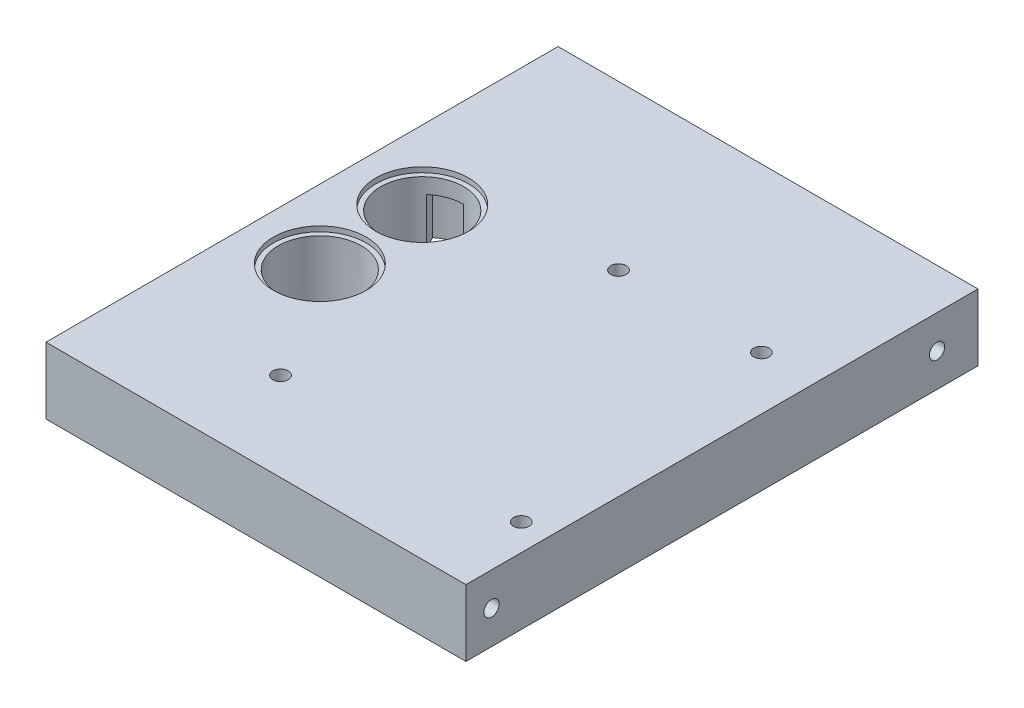
ISO-10303-21;
HEADER;
FILE_DESCRIPTION(('STEP AP214'),'2;1');
FILE_NAME('part.step','',(''),(''),'','','');
FILE_SCHEMA(('AUTOMOTIVE_DESIGN { 1 0 10303 214 1 1 1 1 }'));
ENDSEC;
DATA;
#1=APPLICATION_CONTEXT('core data for automotive mechanical design processes');
#2=APPLICATION_PROTOCOL_DEFINITION('international standard','automotive_design',2000,#1);
#3=PRODUCT_CONTEXT('',#1,'mechanical');
#4=PRODUCT('Part','Part','',(#3));
#5=PRODUCT_RELATED_PRODUCT_CATEGORY('part','',(#4));
#6=PRODUCT_DEFINITION_FORMATION('','',#4);
#7=PRODUCT_DEFINITION_CONTEXT('part definition',#1,'design');
#8=PRODUCT_DEFINITION('design','',#6,#7);
#9=PRODUCT_DEFINITION_SHAPE('','',#8);
#10=(LENGTH_UNIT() NAMED_UNIT(*) SI_UNIT(.MILLI.,.METRE.));
#11=(NAMED_UNIT(*) PLANE_ANGLE_UNIT() SI_UNIT($,.RADIAN.));
#12=(NAMED_UNIT(*) SI_UNIT($,.STERADIAN.) SOLID_ANGLE_UNIT());
#13=UNCERTAINTY_MEASURE_WITH_UNIT(LENGTH_MEASURE(1.E-05),#10,'distance_accuracy_value','');
#14=(GEOMETRIC_REPRESENTATION_CONTEXT(3) GLOBAL_UNCERTAINTY_ASSIGNED_CONTEXT((#13)) GLOBAL_UNIT_ASSIGNED_CONTEXT((#10,
#11,#12)) REPRESENTATION_CONTEXT('',''));
#15=CARTESIAN_POINT('',(0.,0.,0.));
#16=DIRECTION('',(0.,0.,1.));
#17=DIRECTION('',(1.,0.,0.));
#18=AXIS2_PLACEMENT_3D('',#15,#16,#17);
#19=CARTESIAN_POINT('',(0.,-7.,0.));
#20=DIRECTION('',(0.,1.,0.));
#21=DIRECTION('',(0.,0.,1.));
#22=AXIS2_PLACEMENT_3D('',#19,#20,#21);
#23=PLANE('',#22);
#24=DIRECTION('',(-1.,0.,0.));
#25=VECTOR('',#24,1.);
#26=CARTESIAN_POINT('',(33.,-7.00000000000001,-50.));
#27=LINE('',#26,#25);
#28=CARTESIAN_POINT('',(112.,-7.00000000000001,-50.));
#29=VERTEX_POINT('',#28);
#30=CARTESIAN_POINT('',(30.,-7.,-50.));
#31=VERTEX_POINT('',#30);
#32=EDGE_CURVE('E181',#29,#31,#27,.T.);
#33=ORIENTED_EDGE('',*,*,#32,.T.);
#34=DIRECTION('',(0.,0.,-1.));
#35=VECTOR('',#34,1.);
#36=CARTESIAN_POINT('',(30.,-7.,0.));
#37=LINE('',#36,#35);
#38=CARTESIAN_POINT('',(30.,-7.,50.));
#39=VERTEX_POINT('',#38);
#40=EDGE_CURVE('E186',#39,#31,#37,.T.);
#41=ORIENTED_EDGE('',*,*,#40,.F.);
#42=DIRECTION('',(-1.,0.,0.));
#43=VECTOR('',#42,1.);
#44=CARTESIAN_POINT('',(112.,-7.,50.));
#45=LINE('',#44,#43);
#46=CARTESIAN_POINT('',(112.,-7.,50.));
#47=VERTEX_POINT('',#46);
#48=EDGE_CURVE('E209',#47,#39,#45,.T.);
#49=ORIENTED_EDGE('',*,*,#48,.F.);
#50=DIRECTION('',(0.,0.,-1.));
#51=VECTOR('',#50,1.);
#52=CARTESIAN_POINT('',(112.,-7.00000000000001,48.));
#53=LINE('',#52,#51);
#54=EDGE_CURVE('E188',#47,#29,#53,.T.);
#55=ORIENTED_EDGE('',*,*,#54,.T.);
#56=EDGE_LOOP('',(#33,#41,#49,#55));
#57=FACE_BOUND('',#56,.T.);
#58=CARTESIAN_POINT('',(101.6,-7.,-18.1));
#59=DIRECTION('',(0.,1.,0.));
#60=DIRECTION('',(0.,0.,1.));
#61=AXIS2_PLACEMENT_3D('',#58,#59,#60);
#62=CIRCLE('',#61,1.5);
#63=CARTESIAN_POINT('',(101.6,-7.,-16.6));
#64=VERTEX_POINT('',#63);
#65=EDGE_CURVE('E45',#64,#64,#62,.F.);
#66=ORIENTED_EDGE('',*,*,#65,.T.);
#67=EDGE_LOOP('',(#66));
#68=FACE_BOUND('',#67,.T.);
#69=CARTESIAN_POINT('',(43.4696407996142,-7.,10.));
#70=DIRECTION('',(0.,1.,0.));
#71=DIRECTION('',(0.,0.,1.));
#72=AXIS2_PLACEMENT_3D('',#69,#70,#71);
#73=CIRCLE('',#72,9.05);
#74=CARTESIAN_POINT('',(43.4696407996142,-7.,19.05));
#75=VERTEX_POINT('',#74);
#76=EDGE_CURVE('E799',#75,#75,#73,.T.);
#77=ORIENTED_EDGE('',*,*,#76,.F.);
#78=EDGE_LOOP('',(#77));
#79=FACE_BOUND('',#78,.T.);
#80=CARTESIAN_POINT('',(43.4696407996142,-7.,-10.));
#81=DIRECTION('',(0.,1.,0.));
#82=DIRECTION('',(0.,0.,1.));
#83=AXIS2_PLACEMENT_3D('',#80,#81,#82);
#84=CIRCLE('',#83,9.05);
#85=CARTESIAN_POINT('',(43.4696407996142,-7.,-0.95));
#86=VERTEX_POINT('',#85);
#87=EDGE_CURVE('E785',#86,#86,#84,.T.);
#88=ORIENTED_EDGE('',*,*,#87,.F.);
#89=EDGE_LOOP('',(#88));
#90=FACE_BOUND('',#89,.T.);
#91=CARTESIAN_POINT('',(106.8,-7.,34.));
#92=DIRECTION('',(0.,1.,0.));
#93=DIRECTION('',(0.,0.,1.));
#94=AXIS2_PLACEMENT_3D('',#91,#92,#93);
#95=CIRCLE('',#94,1.5);
#96=CARTESIAN_POINT('',(106.8,-7.,35.5));
#97=VERTEX_POINT('',#96);
#98=EDGE_CURVE('E229',#97,#97,#95,.F.);
#99=ORIENTED_EDGE('',*,*,#98,.T.);
#100=EDGE_LOOP('',(#99));
#101=FACE_BOUND('',#100,.T.);
#102=CARTESIAN_POINT('',(58.5,-7.,32.7));
#103=DIRECTION('',(0.,1.,0.));
#104=DIRECTION('',(0.,0.,1.));
#105=AXIS2_PLACEMENT_3D('',#102,#103,#104);
#106=CIRCLE('',#105,1.5);
#107=CARTESIAN_POINT('',(58.5,-7.,34.2));
#108=VERTEX_POINT('',#107);
#109=EDGE_CURVE('E217',#108,#108,#106,.F.);
#110=ORIENTED_EDGE('',*,*,#109,.T.);
#111=EDGE_LOOP('',(#110));
#112=FACE_BOUND('',#111,.T.);
#113=CARTESIAN_POINT('',(73.7,-7.,-18.1));
#114=DIRECTION('',(0.,1.,0.));
#115=DIRECTION('',(0.,0.,1.));
#116=AXIS2_PLACEMENT_3D('',#113,#114,#115);
#117=CIRCLE('',#116,1.5);
#118=CARTESIAN_POINT('',(73.7,-7.,-16.6));
#119=VERTEX_POINT('',#118);
#120=EDGE_CURVE('E210',#119,#119,#117,.F.);
#121=ORIENTED_EDGE('',*,*,#120,.T.);
#122=EDGE_LOOP('',(#121));
#123=FACE_BOUND('',#122,.T.);
#124=ADVANCED_FACE('F41',(#57,#68,#79,#90,#101,#112,#123),#23,.T.);
#125=CARTESIAN_POINT('',(0.,-11.,0.));
#126=DIRECTION('',(0.,-1.,0.));
#127=DIRECTION('',(0.,0.,-1.));
#128=AXIS2_PLACEMENT_3D('',#125,#126,#127);
#129=PLANE('',#128);
#130=CARTESIAN_POINT('',(43.4696407996142,-11.,-10.));
#131=DIRECTION('',(0.,-1.,0.));
#132=DIRECTION('',(0.,0.,-1.));
#133=AXIS2_PLACEMENT_3D('',#130,#131,#132);
#134=CIRCLE('',#133,8.1);
#135=CARTESIAN_POINT('',(51.5679464049852,-11.,-10.1656693152558));
#136=VERTEX_POINT('',#135);
#137=CARTESIAN_POINT('',(49.9848907595689,-11.,-14.8126414742126));
#138=VERTEX_POINT('',#137);
#139=EDGE_CURVE('E768',#136,#138,#134,.F.);
#140=ORIENTED_EDGE('',*,*,#139,.T.);
#141=DIRECTION('',(-0.975923113332999,0.,0.218114824948757));
#142=VECTOR('',#141,1.);
#143=CARTESIAN_POINT('',(52.5936016820828,-11.,-15.3956776974892));
#144=LINE('',#143,#142);
#145=CARTESIAN_POINT('',(52.5936016820828,-11.,-15.3956776974892));
#146=VERTEX_POINT('',#145);
#147=EDGE_CURVE('E820',#146,#138,#144,.T.);
#148=ORIENTED_EDGE('',*,*,#147,.F.);
#149=CARTESIAN_POINT('',(43.4696407996142,-11.,-10.));
#150=DIRECTION('',(0.,-1.,0.));
#151=DIRECTION('',(0.,0.,-1.));
#152=AXIS2_PLACEMENT_3D('',#149,#150,#151);
#153=CIRCLE('',#152,10.6);
#154=CARTESIAN_POINT('',(54.0339338822389,-11.,-10.8693167802409));
#155=VERTEX_POINT('',#154);
#156=EDGE_CURVE('E751',#155,#146,#153,.F.);
#157=ORIENTED_EDGE('',*,*,#156,.F.);
#158=DIRECTION('',(0.961618695996556,0.,-0.274389291900911));
#159=VECTOR('',#158,1.);
#160=CARTESIAN_POINT('',(1.20023216660807,-11.,4.2063073341928));
#161=LINE('',#160,#159);
#162=EDGE_CURVE('E757',#136,#155,#161,.T.);
#163=ORIENTED_EDGE('',*,*,#162,.F.);
#164=EDGE_LOOP('',(#140,#148,#157,#163));
#165=FACE_BOUND('',#164,.T.);
#166=ADVANCED_FACE('F258',(#165),#129,.T.);
#167=CARTESIAN_POINT('',(43.4696407996144,-11.,-20.6));
#168=VERTEX_POINT('',#167);
#169=CARTESIAN_POINT('',(37.0686915926422,-11.,-18.4491330472283));
#170=VERTEX_POINT('',#169);
#171=EDGE_CURVE('E742',#168,#170,#153,.F.);
#172=ORIENTED_EDGE('',*,*,#171,.F.);
#173=DIRECTION('',(0.,0.,-1.));
#174=VECTOR('',#173,1.);
#175=CARTESIAN_POINT('',(43.4696407996143,-11.,-18.1));
#176=LINE('',#175,#174);
#177=CARTESIAN_POINT('',(43.4696407996143,-11.,-18.1));
#178=VERTEX_POINT('',#177);
#179=EDGE_CURVE('E743',#178,#168,#176,.T.);
#180=ORIENTED_EDGE('',*,*,#179,.F.);
#181=CARTESIAN_POINT('',(38.1898633031215,-11.,-16.1427965608124));
#182=VERTEX_POINT('',#181);
#183=EDGE_CURVE('E767',#178,#182,#134,.F.);
#184=ORIENTED_EDGE('',*,*,#183,.T.);
#185=DIRECTION('',(-0.437204036177802,0.,-0.899362346748984));
#186=VECTOR('',#185,1.);
#187=CARTESIAN_POINT('',(37.2373972684535,-11.,-18.1020924896115));
#188=LINE('',#187,#186);
#189=EDGE_CURVE('E746',#182,#170,#188,.T.);
#190=ORIENTED_EDGE('',*,*,#189,.T.);
#191=EDGE_LOOP('',(#172,#180,#184,#190));
#192=FACE_BOUND('',#191,.T.);
#193=ADVANCED_FACE('F263',(#192),#129,.T.);
#194=CARTESIAN_POINT('',(0.,-11.,0.));
#195=DIRECTION('',(0.,-1.,0.));
#196=DIRECTION('',(0.,0.,1.));
#197=AXIS2_PLACEMENT_3D('',#194,#195,#196);
#198=PLANE('',#197);
#199=DIRECTION('',(0.,0.,1.));
#200=VECTOR('',#199,1.);
#201=CARTESIAN_POINT('',(43.4696407996143,-11.,18.1));
#202=LINE('',#201,#200);
#203=CARTESIAN_POINT('',(43.4696407996143,-11.,18.1));
#204=VERTEX_POINT('',#203);
#205=CARTESIAN_POINT('',(43.4696407996144,-11.,20.6));
#206=VERTEX_POINT('',#205);
#207=EDGE_CURVE('E912',#204,#206,#202,.T.);
#208=ORIENTED_EDGE('',*,*,#207,.T.);
#209=CARTESIAN_POINT('',(43.4696407996142,-11.,10.));
#210=DIRECTION('',(0.,1.,0.));
#211=DIRECTION('',(0.,0.,1.));
#212=AXIS2_PLACEMENT_3D('',#209,#210,#211);
#213=CIRCLE('',#212,10.6);
#214=CARTESIAN_POINT('',(37.0686915926422,-11.,18.4491330472283));
#215=VERTEX_POINT('',#214);
#216=EDGE_CURVE('E893',#206,#215,#213,.F.);
#217=ORIENTED_EDGE('',*,*,#216,.T.);
#218=DIRECTION('',(-0.437204036177802,0.,0.899362346748984));
#219=VECTOR('',#218,1.);
#220=CARTESIAN_POINT('',(37.2373972684535,-11.,18.1020924896115));
#221=LINE('',#220,#219);
#222=CARTESIAN_POINT('',(38.1898633031215,-11.,16.1427965608124));
#223=VERTEX_POINT('',#222);
#224=EDGE_CURVE('E900',#223,#215,#221,.T.);
#225=ORIENTED_EDGE('',*,*,#224,.F.);
#226=CARTESIAN_POINT('',(43.4696407996142,-11.,10.));
#227=DIRECTION('',(0.,1.,0.));
#228=DIRECTION('',(0.,0.,1.));
#229=AXIS2_PLACEMENT_3D('',#226,#227,#228);
#230=CIRCLE('',#229,8.1);
#231=EDGE_CURVE('E884',#204,#223,#230,.F.);
#232=ORIENTED_EDGE('',*,*,#231,.F.);
#233=EDGE_LOOP('',(#208,#217,#225,#232));
#234=FACE_BOUND('',#233,.T.);
#235=ADVANCED_FACE('F690',(#234),#198,.T.);
#236=DIRECTION('',(-0.975923113332999,0.,-0.218114824948757));
#237=VECTOR('',#236,1.);
#238=CARTESIAN_POINT('',(52.5936016820828,-11.,15.3956776974892));
#239=LINE('',#238,#237);
#240=CARTESIAN_POINT('',(52.5936016820828,-11.,15.3956776974892));
#241=VERTEX_POINT('',#240);
#242=CARTESIAN_POINT('',(49.9848907595689,-11.,14.8126414742126));
#243=VERTEX_POINT('',#242);
#244=EDGE_CURVE('E915',#241,#243,#239,.T.);
#245=ORIENTED_EDGE('',*,*,#244,.T.);
#246=CARTESIAN_POINT('',(51.5679464049852,-11.,10.1656693152558));
#247=VERTEX_POINT('',#246);
#248=EDGE_CURVE('E878',#247,#243,#230,.F.);
#249=ORIENTED_EDGE('',*,*,#248,.F.);
#250=DIRECTION('',(0.961618695996556,0.,0.274389291900911));
#251=VECTOR('',#250,1.);
#252=CARTESIAN_POINT('',(1.20023216660807,-11.,-4.2063073341928));
#253=LINE('',#252,#251);
#254=CARTESIAN_POINT('',(54.0339338822389,-11.,10.8693167802408));
#255=VERTEX_POINT('',#254);
#256=EDGE_CURVE('E872',#247,#255,#253,.T.);
#257=ORIENTED_EDGE('',*,*,#256,.T.);
#258=EDGE_CURVE('E896',#255,#241,#213,.F.);
#259=ORIENTED_EDGE('',*,*,#258,.T.);
#260=EDGE_LOOP('',(#245,#249,#257,#259));
#261=FACE_BOUND('',#260,.T.);
#262=ADVANCED_FACE('F680',(#261),#198,.T.);
#263=CARTESIAN_POINT('',(107.,-13.5,-42.));
#264=DIRECTION('',(1.,0.,0.));
#265=DIRECTION('',(0.,0.,-1.));
#266=AXIS2_PLACEMENT_3D('',#263,#264,#265);
#267=PLANE('',#266);
#268=CARTESIAN_POINT('',(107.,-13.5,-42.));
#269=DIRECTION('',(1.,0.,0.));
#270=DIRECTION('',(0.,0.,-1.));
#271=AXIS2_PLACEMENT_3D('',#268,#269,#270);
#272=CIRCLE('',#271,1.5);
#273=CARTESIAN_POINT('',(107.,-13.5,-43.5));
#274=VERTEX_POINT('',#273);
#275=EDGE_CURVE('E946',#274,#274,#272,.T.);
#276=ORIENTED_EDGE('',*,*,#275,.T.);
#277=EDGE_LOOP('',(#276));
#278=FACE_BOUND('',#277,.T.);
#279=ADVANCED_FACE('F670',(#278),#267,.T.);
#280=CARTESIAN_POINT('',(107.,-13.5,45.));
#281=DIRECTION('',(1.,0.,0.));
#282=DIRECTION('',(0.,0.,-1.));
#283=AXIS2_PLACEMENT_3D('',#280,#281,#282);
#284=PLANE('',#283);
#285=CARTESIAN_POINT('',(107.,-13.5,45.));
#286=DIRECTION('',(1.,0.,0.));
#287=DIRECTION('',(0.,0.,-1.));
#288=AXIS2_PLACEMENT_3D('',#285,#286,#287);
#289=CIRCLE('',#288,1.5);
#290=CARTESIAN_POINT('',(107.,-13.5,43.5));
#291=VERTEX_POINT('',#290);
#292=EDGE_CURVE('E941',#291,#291,#289,.T.);
#293=ORIENTED_EDGE('',*,*,#292,.T.);
#294=EDGE_LOOP('',(#293));
#295=FACE_BOUND('',#294,.T.);
#296=ADVANCED_FACE('F661',(#295),#284,.T.);
#297=CARTESIAN_POINT('',(43.4696407996142,-11.,-10.));
#298=DIRECTION('',(0.,-1.,0.));
#299=DIRECTION('',(0.,0.,-1.));
#300=AXIS2_PLACEMENT_3D('',#297,#298,#299);
#301=CYLINDRICAL_SURFACE('',#300,10.6);
#302=CARTESIAN_POINT('',(43.4696407996142,-20.,-10.));
#303=DIRECTION('',(0.,-1.,0.));
#304=DIRECTION('',(0.,0.,-1.));
#305=AXIS2_PLACEMENT_3D('',#302,#303,#304);
#306=CIRCLE('',#305,10.6);
#307=CARTESIAN_POINT('',(43.4696407996144,-20.,-20.6));
#308=VERTEX_POINT('',#307);
#309=CARTESIAN_POINT('',(37.0686915926422,-20.,-18.4491330472283));
#310=VERTEX_POINT('',#309);
#311=EDGE_CURVE('E779',#308,#310,#306,.F.);
#312=ORIENTED_EDGE('',*,*,#311,.F.);
#313=DIRECTION('',(0.,1.,0.));
#314=VECTOR('',#313,1.);
#315=CARTESIAN_POINT('',(43.4696407996144,-30.8046370087486,-20.6));
#316=LINE('',#315,#314);
#317=EDGE_CURVE('E763',#308,#168,#316,.T.);
#318=ORIENTED_EDGE('',*,*,#317,.T.);
#319=ORIENTED_EDGE('',*,*,#171,.T.);
#320=DIRECTION('',(0.,-1.,0.));
#321=VECTOR('',#320,1.);
#322=CARTESIAN_POINT('',(37.0686915926422,-11.,-18.4491330472283));
#323=LINE('',#322,#321);
#324=EDGE_CURVE('E782',#170,#310,#323,.T.);
#325=ORIENTED_EDGE('',*,*,#324,.T.);
#326=EDGE_LOOP('',(#312,#318,#319,#325));
#327=FACE_BOUND('',#326,.T.);
#328=ADVANCED_FACE('F634',(#327),#301,.F.);
#329=CARTESIAN_POINT('',(43.4696407996143,-30.8046370087486,-18.1));
#330=DIRECTION('',(1.,0.,0.));
#331=DIRECTION('',(0.,0.,-1.));
#332=AXIS2_PLACEMENT_3D('',#329,#330,#331);
#333=PLANE('',#332);
#334=DIRECTION('',(0.,0.,-1.));
#335=VECTOR('',#334,1.);
#336=CARTESIAN_POINT('',(43.4696407996143,-20.,-18.1));
#337=LINE('',#336,#335);
#338=CARTESIAN_POINT('',(43.4696407996143,-20.,-18.1));
#339=VERTEX_POINT('',#338);
#340=EDGE_CURVE('E830',#339,#308,#337,.T.);
#341=ORIENTED_EDGE('',*,*,#340,.F.);
#342=DIRECTION('',(0.,1.,0.));
#343=VECTOR('',#342,1.);
#344=CARTESIAN_POINT('',(43.4696407996143,-30.8046370087486,-18.1));
#345=LINE('',#344,#343);
#346=EDGE_CURVE('E842',#339,#178,#345,.T.);
#347=ORIENTED_EDGE('',*,*,#346,.T.);
#348=ORIENTED_EDGE('',*,*,#179,.T.);
#349=ORIENTED_EDGE('',*,*,#317,.F.);
#350=EDGE_LOOP('',(#341,#347,#348,#349));
#351=FACE_BOUND('',#350,.T.);
#352=ADVANCED_FACE('F642',(#351),#333,.F.);
#353=CARTESIAN_POINT('',(52.5936016820828,-30.8046370087486,-15.3956776974892));
#354=DIRECTION('',(-0.218114824948757,0.,-0.975923113332999));
#355=DIRECTION('',(-0.975923113332999,0.,0.218114824948757));
#356=AXIS2_PLACEMENT_3D('',#353,#354,#355);
#357=PLANE('',#356);
#358=DIRECTION('',(-0.975923113332999,0.,0.218114824948757));
#359=VECTOR('',#358,1.);
#360=CARTESIAN_POINT('',(52.5936016820828,-20.,-15.3956776974892));
#361=LINE('',#360,#359);
#362=CARTESIAN_POINT('',(52.5936016820828,-20.,-15.3956776974892));
#363=VERTEX_POINT('',#362);
#364=CARTESIAN_POINT('',(49.9848907595689,-20.,-14.8126414742126));
#365=VERTEX_POINT('',#364);
#366=EDGE_CURVE('E825',#363,#365,#361,.T.);
#367=ORIENTED_EDGE('',*,*,#366,.F.);
#368=DIRECTION('',(0.,1.,0.));
#369=VECTOR('',#368,1.);
#370=CARTESIAN_POINT('',(52.5936016820828,-30.8046370087486,-15.3956776974892));
#371=LINE('',#370,#369);
#372=EDGE_CURVE('E822',#363,#146,#371,.T.);
#373=ORIENTED_EDGE('',*,*,#372,.T.);
#374=ORIENTED_EDGE('',*,*,#147,.T.);
#375=DIRECTION('',(0.,1.,0.));
#376=VECTOR('',#375,1.);
#377=CARTESIAN_POINT('',(49.9848907595689,-30.8046370087486,-14.8126414742126));
#378=LINE('',#377,#376);
#379=EDGE_CURVE('E840',#365,#138,#378,.T.);
#380=ORIENTED_EDGE('',*,*,#379,.F.);
#381=EDGE_LOOP('',(#367,#373,#374,#380));
#382=FACE_BOUND('',#381,.T.);
#383=ADVANCED_FACE('F631',(#382),#357,.F.);
#384=ORIENTED_EDGE('',*,*,#156,.T.);
#385=ORIENTED_EDGE('',*,*,#372,.F.);
#386=CARTESIAN_POINT('',(54.0339338822389,-20.,-10.8693167802409));
#387=VERTEX_POINT('',#386);
#388=EDGE_CURVE('E775',#387,#363,#306,.F.);
#389=ORIENTED_EDGE('',*,*,#388,.F.);
#390=DIRECTION('',(0.,-1.,0.));
#391=VECTOR('',#390,1.);
#392=CARTESIAN_POINT('',(54.0339338822389,-11.,-10.8693167802409));
#393=LINE('',#392,#391);
#394=EDGE_CURVE('E774',#155,#387,#393,.T.);
#395=ORIENTED_EDGE('',*,*,#394,.F.);
#396=EDGE_LOOP('',(#384,#385,#389,#395));
#397=FACE_BOUND('',#396,.T.);
#398=ADVANCED_FACE('F621',(#397),#301,.F.);
#399=CARTESIAN_POINT('',(1.20023216660807,-11.,4.2063073341928));
#400=DIRECTION('',(-0.274389291900911,0.,-0.961618695996556));
#401=DIRECTION('',(-0.961618695996556,0.,0.274389291900911));
#402=AXIS2_PLACEMENT_3D('',#399,#400,#401);
#403=PLANE('',#402);
#404=DIRECTION('',(0.961618695996556,0.,-0.274389291900911));
#405=VECTOR('',#404,1.);
#406=CARTESIAN_POINT('',(1.20023216660807,-20.,4.2063073341928));
#407=LINE('',#406,#405);
#408=CARTESIAN_POINT('',(51.5679464049852,-20.,-10.1656693152558));
#409=VERTEX_POINT('',#408);
#410=EDGE_CURVE('E759',#409,#387,#407,.T.);
#411=ORIENTED_EDGE('',*,*,#410,.F.);
#412=DIRECTION('',(0.,-1.,0.));
#413=VECTOR('',#412,1.);
#414=CARTESIAN_POINT('',(51.5679464049852,-11.,-10.1656693152558));
#415=LINE('',#414,#413);
#416=EDGE_CURVE('E789',#136,#409,#415,.T.);
#417=ORIENTED_EDGE('',*,*,#416,.F.);
#418=ORIENTED_EDGE('',*,*,#162,.T.);
#419=ORIENTED_EDGE('',*,*,#394,.T.);
#420=EDGE_LOOP('',(#411,#417,#418,#419));
#421=FACE_BOUND('',#420,.T.);
#422=ADVANCED_FACE('F610',(#421),#403,.T.);
#423=CARTESIAN_POINT('',(43.4696407996142,-20.,-10.));
#424=DIRECTION('',(0.,1.,0.));
#425=DIRECTION('',(0.,0.,1.));
#426=AXIS2_PLACEMENT_3D('',#423,#424,#425);
#427=CYLINDRICAL_SURFACE('',#426,8.1);
#428=CARTESIAN_POINT('',(43.4696407996142,-20.,-10.));
#429=DIRECTION('',(0.,1.,0.));
#430=DIRECTION('',(0.,0.,1.));
#431=AXIS2_PLACEMENT_3D('',#428,#429,#430);
#432=CIRCLE('',#431,8.1);
#433=CARTESIAN_POINT('',(38.1898633031215,-20.,-16.1427965608124));
#434=VERTEX_POINT('',#433);
#435=EDGE_CURVE('E328',#434,#409,#432,.T.);
#436=ORIENTED_EDGE('',*,*,#435,.F.);
#437=DIRECTION('',(0.,-1.,0.));
#438=VECTOR('',#437,1.);
#439=CARTESIAN_POINT('',(38.1898633031215,-11.,-16.1427965608124));
#440=LINE('',#439,#438);
#441=EDGE_CURVE('E786',#182,#434,#440,.T.);
#442=ORIENTED_EDGE('',*,*,#441,.F.);
#443=ORIENTED_EDGE('',*,*,#183,.F.);
#444=ORIENTED_EDGE('',*,*,#346,.F.);
#445=CARTESIAN_POINT('',(43.4696407996142,-20.,-9.99999999999997));
#446=DIRECTION('',(0.,-1.,0.));
#447=DIRECTION('',(0.,0.,-1.));
#448=AXIS2_PLACEMENT_3D('',#445,#446,#447);
#449=CIRCLE('',#448,8.10000000000003);
#450=EDGE_CURVE('E827',#365,#339,#449,.F.);
#451=ORIENTED_EDGE('',*,*,#450,.F.);
#452=ORIENTED_EDGE('',*,*,#379,.T.);
#453=ORIENTED_EDGE('',*,*,#139,.F.);
#454=ORIENTED_EDGE('',*,*,#416,.T.);
#455=EDGE_LOOP('',(#436,#442,#443,#444,#451,#452,#453,#454));
#456=FACE_BOUND('',#455,.T.);
#457=CARTESIAN_POINT('',(43.4696407996142,-8.,-10.));
#458=DIRECTION('',(0.,1.,0.));
#459=DIRECTION('',(0.,0.,1.));
#460=AXIS2_PLACEMENT_3D('',#457,#458,#459);
#461=CIRCLE('',#460,8.1);
#462=CARTESIAN_POINT('',(43.4696407996142,-8.,-1.9));
#463=VERTEX_POINT('',#462);
#464=EDGE_CURVE('E324',#463,#463,#461,.F.);
#465=ORIENTED_EDGE('',*,*,#464,.F.);
#466=EDGE_LOOP('',(#465));
#467=FACE_BOUND('',#466,.T.);
#468=ADVANCED_FACE('F600',(#456,#467),#427,.F.);
#469=CARTESIAN_POINT('',(37.2373972684535,-11.,-18.1020924896115));
#470=DIRECTION('',(-0.899362346748984,0.,0.437204036177802));
#471=DIRECTION('',(0.437204036177802,0.,0.899362346748984));
#472=AXIS2_PLACEMENT_3D('',#469,#470,#471);
#473=PLANE('',#472);
#474=DIRECTION('',(-0.437204036177802,0.,-0.899362346748984));
#475=VECTOR('',#474,1.);
#476=CARTESIAN_POINT('',(37.2373972684535,-20.,-18.1020924896115));
#477=LINE('',#476,#475);
#478=EDGE_CURVE('E752',#434,#310,#477,.T.);
#479=ORIENTED_EDGE('',*,*,#478,.T.);
#480=ORIENTED_EDGE('',*,*,#324,.F.);
#481=ORIENTED_EDGE('',*,*,#189,.F.);
#482=ORIENTED_EDGE('',*,*,#441,.T.);
#483=EDGE_LOOP('',(#479,#480,#481,#482));
#484=FACE_BOUND('',#483,.T.);
#485=ADVANCED_FACE('F592',(#484),#473,.F.);
#486=CARTESIAN_POINT('',(43.4696407996142,-11.,10.));
#487=DIRECTION('',(0.,-1.,0.));
#488=DIRECTION('',(0.,0.,-1.));
#489=AXIS2_PLACEMENT_3D('',#486,#487,#488);
#490=CYLINDRICAL_SURFACE('',#489,10.6);
#491=CARTESIAN_POINT('',(43.4696407996142,-20.,9.99999999999999));
#492=DIRECTION('',(0.,1.,0.));
#493=DIRECTION('',(0.,0.,1.));
#494=AXIS2_PLACEMENT_3D('',#491,#492,#493);
#495=CIRCLE('',#494,10.6);
#496=CARTESIAN_POINT('',(54.0339338822389,-20.,10.8693167802408));
#497=VERTEX_POINT('',#496);
#498=CARTESIAN_POINT('',(52.5936016820828,-20.,15.3956776974892));
#499=VERTEX_POINT('',#498);
#500=EDGE_CURVE('E67',#497,#499,#495,.F.);
#501=ORIENTED_EDGE('',*,*,#500,.T.);
#502=DIRECTION('',(0.,1.,0.));
#503=VECTOR('',#502,1.);
#504=CARTESIAN_POINT('',(52.5936016820828,-30.8046370087486,15.3956776974892));
#505=LINE('',#504,#503);
#506=EDGE_CURVE('E902',#499,#241,#505,.T.);
#507=ORIENTED_EDGE('',*,*,#506,.T.);
#508=ORIENTED_EDGE('',*,*,#258,.F.);
#509=DIRECTION('',(0.,-1.,0.));
#510=VECTOR('',#509,1.);
#511=CARTESIAN_POINT('',(54.0339338822389,-11.,10.8693167802408));
#512=LINE('',#511,#510);
#513=EDGE_CURVE('E854',#255,#497,#512,.T.);
#514=ORIENTED_EDGE('',*,*,#513,.T.);
#515=EDGE_LOOP('',(#501,#507,#508,#514));
#516=FACE_BOUND('',#515,.T.);
#517=ADVANCED_FACE('F565',(#516),#490,.F.);
#518=CARTESIAN_POINT('',(52.5936016820828,-30.8046370087486,15.3956776974892));
#519=DIRECTION('',(0.218114824948757,0.,-0.975923113332998));
#520=DIRECTION('',(-0.975923113332999,0.,-0.218114824948757));
#521=AXIS2_PLACEMENT_3D('',#518,#519,#520);
#522=PLANE('',#521);
#523=ORIENTED_EDGE('',*,*,#506,.F.);
#524=DIRECTION('',(-0.975923113332999,0.,-0.218114824948757));
#525=VECTOR('',#524,1.);
#526=CARTESIAN_POINT('',(52.5936016820828,-20.,15.3956776974892));
#527=LINE('',#526,#525);
#528=CARTESIAN_POINT('',(49.9848907595689,-20.,14.8126414742126));
#529=VERTEX_POINT('',#528);
#530=EDGE_CURVE('E914',#499,#529,#527,.T.);
#531=ORIENTED_EDGE('',*,*,#530,.T.);
#532=DIRECTION('',(0.,1.,0.));
#533=VECTOR('',#532,1.);
#534=CARTESIAN_POINT('',(49.9848907595689,-30.8046370087486,14.8126414742126));
#535=LINE('',#534,#533);
#536=EDGE_CURVE('E928',#529,#243,#535,.T.);
#537=ORIENTED_EDGE('',*,*,#536,.T.);
#538=ORIENTED_EDGE('',*,*,#244,.F.);
#539=EDGE_LOOP('',(#523,#531,#537,#538));
#540=FACE_BOUND('',#539,.T.);
#541=ADVANCED_FACE('F573',(#540),#522,.T.);
#542=CARTESIAN_POINT('',(43.4696407996143,-30.8046370087486,18.1));
#543=DIRECTION('',(-1.,0.,0.));
#544=DIRECTION('',(0.,0.,1.));
#545=AXIS2_PLACEMENT_3D('',#542,#543,#544);
#546=PLANE('',#545);
#547=DIRECTION('',(0.,1.,0.));
#548=VECTOR('',#547,1.);
#549=CARTESIAN_POINT('',(43.4696407996143,-30.8046370087486,18.1));
#550=LINE('',#549,#548);
#551=CARTESIAN_POINT('',(43.4696407996143,-20.,18.1));
#552=VERTEX_POINT('',#551);
#553=EDGE_CURVE('E910',#552,#204,#550,.T.);
#554=ORIENTED_EDGE('',*,*,#553,.F.);
#555=DIRECTION('',(0.,0.,1.));
#556=VECTOR('',#555,1.);
#557=CARTESIAN_POINT('',(43.4696407996143,-20.,18.1));
#558=LINE('',#557,#556);
#559=CARTESIAN_POINT('',(43.4696407996144,-20.,20.6));
#560=VERTEX_POINT('',#559);
#561=EDGE_CURVE('E918',#552,#560,#558,.T.);
#562=ORIENTED_EDGE('',*,*,#561,.T.);
#563=DIRECTION('',(0.,1.,0.));
#564=VECTOR('',#563,1.);
#565=CARTESIAN_POINT('',(43.4696407996144,-30.8046370087486,20.6));
#566=LINE('',#565,#564);
#567=EDGE_CURVE('E59',#560,#206,#566,.T.);
#568=ORIENTED_EDGE('',*,*,#567,.T.);
#569=ORIENTED_EDGE('',*,*,#207,.F.);
#570=EDGE_LOOP('',(#554,#562,#568,#569));
#571=FACE_BOUND('',#570,.T.);
#572=ADVANCED_FACE('F563',(#571),#546,.T.);
#573=ORIENTED_EDGE('',*,*,#216,.F.);
#574=ORIENTED_EDGE('',*,*,#567,.F.);
#575=CARTESIAN_POINT('',(37.0686915926423,-20.,18.4491330472283));
#576=VERTEX_POINT('',#575);
#577=EDGE_CURVE('E890',#560,#576,#495,.F.);
#578=ORIENTED_EDGE('',*,*,#577,.T.);
#579=DIRECTION('',(0.,-1.,0.));
#580=VECTOR('',#579,1.);
#581=CARTESIAN_POINT('',(37.0686915926422,-11.,18.4491330472283));
#582=LINE('',#581,#580);
#583=EDGE_CURVE('E848',#215,#576,#582,.T.);
#584=ORIENTED_EDGE('',*,*,#583,.F.);
#585=EDGE_LOOP('',(#573,#574,#578,#584));
#586=FACE_BOUND('',#585,.T.);
#587=ADVANCED_FACE('F553',(#586),#490,.F.);
#588=CARTESIAN_POINT('',(37.2373972684535,-11.,18.1020924896115));
#589=DIRECTION('',(0.899362346748984,0.,0.437204036177802));
#590=DIRECTION('',(0.437204036177802,0.,-0.899362346748984));
#591=AXIS2_PLACEMENT_3D('',#588,#589,#590);
#592=PLANE('',#591);
#593=DIRECTION('',(-0.437204036177802,0.,0.899362346748984));
#594=VECTOR('',#593,1.);
#595=CARTESIAN_POINT('',(37.2373972684535,-20.,18.1020924896114));
#596=LINE('',#595,#594);
#597=CARTESIAN_POINT('',(38.1898633031215,-20.,16.1427965608124));
#598=VERTEX_POINT('',#597);
#599=EDGE_CURVE('E889',#598,#576,#596,.T.);
#600=ORIENTED_EDGE('',*,*,#599,.F.);
#601=DIRECTION('',(0.,-1.,0.));
#602=VECTOR('',#601,1.);
#603=CARTESIAN_POINT('',(38.1898633031215,-11.,16.1427965608124));
#604=LINE('',#603,#602);
#605=EDGE_CURVE('E861',#223,#598,#604,.T.);
#606=ORIENTED_EDGE('',*,*,#605,.F.);
#607=ORIENTED_EDGE('',*,*,#224,.T.);
#608=ORIENTED_EDGE('',*,*,#583,.T.);
#609=EDGE_LOOP('',(#600,#606,#607,#608));
#610=FACE_BOUND('',#609,.T.);
#611=ADVANCED_FACE('F542',(#610),#592,.T.);
#612=CARTESIAN_POINT('',(43.4696407996142,-20.,10.));
#613=DIRECTION('',(0.,1.,0.));
#614=DIRECTION('',(0.,0.,1.));
#615=AXIS2_PLACEMENT_3D('',#612,#613,#614);
#616=CYLINDRICAL_SURFACE('',#615,8.1);
#617=CARTESIAN_POINT('',(43.4696407996142,-20.,10.));
#618=DIRECTION('',(0.,1.,0.));
#619=DIRECTION('',(0.,0.,1.));
#620=AXIS2_PLACEMENT_3D('',#617,#618,#619);
#621=CIRCLE('',#620,8.1);
#622=CARTESIAN_POINT('',(51.5679464049852,-20.,10.1656693152558));
#623=VERTEX_POINT('',#622);
#624=EDGE_CURVE('E333',#623,#598,#621,.T.);
#625=ORIENTED_EDGE('',*,*,#624,.F.);
#626=DIRECTION('',(0.,-1.,0.));
#627=VECTOR('',#626,1.);
#628=CARTESIAN_POINT('',(51.5679464049852,-11.,10.1656693152558));
#629=LINE('',#628,#627);
#630=EDGE_CURVE('E856',#247,#623,#629,.T.);
#631=ORIENTED_EDGE('',*,*,#630,.F.);
#632=ORIENTED_EDGE('',*,*,#248,.T.);
#633=ORIENTED_EDGE('',*,*,#536,.F.);
#634=CARTESIAN_POINT('',(43.4696407996142,-20.,9.99999999999997));
#635=DIRECTION('',(0.,-1.,0.));
#636=DIRECTION('',(0.,0.,-1.));
#637=AXIS2_PLACEMENT_3D('',#634,#635,#636);
#638=CIRCLE('',#637,8.10000000000003);
#639=EDGE_CURVE('E926',#529,#552,#638,.T.);
#640=ORIENTED_EDGE('',*,*,#639,.T.);
#641=ORIENTED_EDGE('',*,*,#553,.T.);
#642=ORIENTED_EDGE('',*,*,#231,.T.);
#643=ORIENTED_EDGE('',*,*,#605,.T.);
#644=EDGE_LOOP('',(#625,#631,#632,#633,#640,#641,#642,#643));
#645=FACE_BOUND('',#644,.T.);
#646=CARTESIAN_POINT('',(43.4696407996142,-8.,10.));
#647=DIRECTION('',(0.,1.,0.));
#648=DIRECTION('',(0.,0.,1.));
#649=AXIS2_PLACEMENT_3D('',#646,#647,#648);
#650=CIRCLE('',#649,8.1);
#651=CARTESIAN_POINT('',(43.4696407996142,-8.,18.1));
#652=VERTEX_POINT('',#651);
#653=EDGE_CURVE('E321',#652,#652,#650,.F.);
#654=ORIENTED_EDGE('',*,*,#653,.F.);
#655=EDGE_LOOP('',(#654));
#656=FACE_BOUND('',#655,.T.);
#657=ADVANCED_FACE('F532',(#645,#656),#616,.F.);
#658=CARTESIAN_POINT('',(1.20023216660807,-11.,-4.2063073341928));
#659=DIRECTION('',(0.274389291900911,0.,-0.961618695996556));
#660=DIRECTION('',(-0.961618695996556,0.,-0.274389291900911));
#661=AXIS2_PLACEMENT_3D('',#658,#659,#660);
#662=PLANE('',#661);
#663=DIRECTION('',(0.961618695996556,0.,0.274389291900911));
#664=VECTOR('',#663,1.);
#665=CARTESIAN_POINT('',(1.20023216660807,-20.,-4.2063073341928));
#666=LINE('',#665,#664);
#667=EDGE_CURVE('E864',#623,#497,#666,.T.);
#668=ORIENTED_EDGE('',*,*,#667,.T.);
#669=ORIENTED_EDGE('',*,*,#513,.F.);
#670=ORIENTED_EDGE('',*,*,#256,.F.);
#671=ORIENTED_EDGE('',*,*,#630,.T.);
#672=EDGE_LOOP('',(#668,#669,#670,#671));
#673=FACE_BOUND('',#672,.T.);
#674=ADVANCED_FACE('F522',(#673),#662,.F.);
#675=CARTESIAN_POINT('',(106.,-13.5,-45.));
#676=DIRECTION('',(0.,0.,-1.));
#677=DIRECTION('',(0.,1.,0.));
#678=AXIS2_PLACEMENT_3D('',#675,#676,#677);
#679=PLANE('',#678);
#680=CARTESIAN_POINT('',(106.,-13.5,-45.));
#681=DIRECTION('',(0.,0.,-1.));
#682=DIRECTION('',(0.,1.,0.));
#683=AXIS2_PLACEMENT_3D('',#680,#681,#682);
#684=CIRCLE('',#683,1.5);
#685=CARTESIAN_POINT('',(106.,-12.,-45.));
#686=VERTEX_POINT('',#685);
#687=EDGE_CURVE('E947',#686,#686,#684,.T.);
#688=ORIENTED_EDGE('',*,*,#687,.T.);
#689=EDGE_LOOP('',(#688));
#690=FACE_BOUND('',#689,.T.);
#691=ADVANCED_FACE('F512',(#690),#679,.T.);
#692=CARTESIAN_POINT('',(36.,-13.5,-45.));
#693=DIRECTION('',(0.,0.,-1.));
#694=DIRECTION('',(0.,1.,0.));
#695=AXIS2_PLACEMENT_3D('',#692,#693,#694);
#696=PLANE('',#695);
#697=CARTESIAN_POINT('',(36.,-13.5,-45.));
#698=DIRECTION('',(0.,0.,-1.));
#699=DIRECTION('',(0.,1.,0.));
#700=AXIS2_PLACEMENT_3D('',#697,#698,#699);
#701=CIRCLE('',#700,1.5);
#702=CARTESIAN_POINT('',(36.,-12.,-45.));
#703=VERTEX_POINT('',#702);
#704=EDGE_CURVE('E961',#703,#703,#701,.T.);
#705=ORIENTED_EDGE('',*,*,#704,.T.);
#706=EDGE_LOOP('',(#705));
#707=FACE_BOUND('',#706,.T.);
#708=ADVANCED_FACE('F502',(#707),#696,.T.);
#709=CARTESIAN_POINT('',(107.,-13.5,-42.));
#710=DIRECTION('',(1.,0.,0.));
#711=DIRECTION('',(0.,0.,-1.));
#712=AXIS2_PLACEMENT_3D('',#709,#710,#711);
#713=CYLINDRICAL_SURFACE('',#712,1.5);
#714=ORIENTED_EDGE('',*,*,#275,.F.);
#715=EDGE_LOOP('',(#714));
#716=FACE_BOUND('',#715,.T.);
#717=CARTESIAN_POINT('',(112.,-13.5,-42.));
#718=DIRECTION('',(1.,0.,0.));
#719=DIRECTION('',(0.,0.,-1.));
#720=AXIS2_PLACEMENT_3D('',#717,#718,#719);
#721=CIRCLE('',#720,1.5);
#722=CARTESIAN_POINT('',(112.,-13.5,-43.5));
#723=VERTEX_POINT('',#722);
#724=EDGE_CURVE('E942',#723,#723,#721,.T.);
#725=ORIENTED_EDGE('',*,*,#724,.T.);
#726=EDGE_LOOP('',(#725));
#727=FACE_BOUND('',#726,.T.);
#728=ADVANCED_FACE('F491',(#716,#727),#713,.F.);
#729=CARTESIAN_POINT('',(107.,-13.5,45.));
#730=DIRECTION('',(1.,0.,0.));
#731=DIRECTION('',(0.,0.,-1.));
#732=AXIS2_PLACEMENT_3D('',#729,#730,#731);
#733=CYLINDRICAL_SURFACE('',#732,1.5);
#734=ORIENTED_EDGE('',*,*,#292,.F.);
#735=EDGE_LOOP('',(#734));
#736=FACE_BOUND('',#735,.T.);
#737=CARTESIAN_POINT('',(112.,-13.5,45.));
#738=DIRECTION('',(1.,0.,0.));
#739=DIRECTION('',(0.,0.,-1.));
#740=AXIS2_PLACEMENT_3D('',#737,#738,#739);
#741=CIRCLE('',#740,1.5);
#742=CARTESIAN_POINT('',(112.,-13.5,43.5));
#743=VERTEX_POINT('',#742);
#744=EDGE_CURVE('E951',#743,#743,#741,.T.);
#745=ORIENTED_EDGE('',*,*,#744,.T.);
#746=EDGE_LOOP('',(#745));
#747=FACE_BOUND('',#746,.T.);
#748=ADVANCED_FACE('F286',(#736,#747),#733,.F.);
#749=CARTESIAN_POINT('',(30.,0.,0.));
#750=DIRECTION('',(-1.,0.,0.));
#751=DIRECTION('',(0.,0.,1.));
#752=AXIS2_PLACEMENT_3D('',#749,#750,#751);
#753=PLANE('',#752);
#754=DIRECTION('',(0.,1.,0.));
#755=VECTOR('',#754,1.);
#756=CARTESIAN_POINT('',(30.,0.,50.));
#757=LINE('',#756,#755);
#758=CARTESIAN_POINT('',(30.,-20.,50.));
#759=VERTEX_POINT('',#758);
#760=EDGE_CURVE('E207',#759,#39,#757,.T.);
#761=ORIENTED_EDGE('',*,*,#760,.T.);
#762=ORIENTED_EDGE('',*,*,#40,.T.);
#763=DIRECTION('',(0.,1.,0.));
#764=VECTOR('',#763,1.);
#765=CARTESIAN_POINT('',(30.,0.,-50.));
#766=LINE('',#765,#764);
#767=CARTESIAN_POINT('',(30.,-20.,-50.));
#768=VERTEX_POINT('',#767);
#769=EDGE_CURVE('E196',#768,#31,#766,.T.);
#770=ORIENTED_EDGE('',*,*,#769,.F.);
#771=DIRECTION('',(0.,0.,1.));
#772=VECTOR('',#771,1.);
#773=CARTESIAN_POINT('',(30.,-20.,0.));
#774=LINE('',#773,#772);
#775=EDGE_CURVE('E203',#768,#759,#774,.T.);
#776=ORIENTED_EDGE('',*,*,#775,.T.);
#777=EDGE_LOOP('',(#761,#762,#770,#776));
#778=FACE_BOUND('',#777,.T.);
#779=ADVANCED_FACE('F205',(#778),#753,.T.);
#780=CARTESIAN_POINT('',(112.,-20.,0.));
#781=DIRECTION('',(0.,-1.,0.));
#782=DIRECTION('',(0.,0.,-1.));
#783=AXIS2_PLACEMENT_3D('',#780,#781,#782);
#784=PLANE('',#783);
#785=ORIENTED_EDGE('',*,*,#667,.F.);
#786=ORIENTED_EDGE('',*,*,#624,.T.);
#787=ORIENTED_EDGE('',*,*,#599,.T.);
#788=ORIENTED_EDGE('',*,*,#577,.F.);
#789=ORIENTED_EDGE('',*,*,#561,.F.);
#790=ORIENTED_EDGE('',*,*,#639,.F.);
#791=ORIENTED_EDGE('',*,*,#530,.F.);
#792=ORIENTED_EDGE('',*,*,#500,.F.);
#793=EDGE_LOOP('',(#785,#786,#787,#788,#789,#790,#791,#792));
#794=FACE_BOUND('',#793,.T.);
#795=ORIENTED_EDGE('',*,*,#478,.F.);
#796=ORIENTED_EDGE('',*,*,#435,.T.);
#797=ORIENTED_EDGE('',*,*,#410,.T.);
#798=ORIENTED_EDGE('',*,*,#388,.T.);
#799=ORIENTED_EDGE('',*,*,#366,.T.);
#800=ORIENTED_EDGE('',*,*,#450,.T.);
#801=ORIENTED_EDGE('',*,*,#340,.T.);
#802=ORIENTED_EDGE('',*,*,#311,.T.);
#803=EDGE_LOOP('',(#795,#796,#797,#798,#799,#800,#801,#802));
#804=FACE_BOUND('',#803,.T.);
#805=ORIENTED_EDGE('',*,*,#775,.F.);
#806=DIRECTION('',(-1.,0.,0.));
#807=VECTOR('',#806,1.);
#808=CARTESIAN_POINT('',(112.,-20.,-50.));
#809=LINE('',#808,#807);
#810=CARTESIAN_POINT('',(112.,-20.,-50.));
#811=VERTEX_POINT('',#810);
#812=EDGE_CURVE('E51',#811,#768,#809,.T.);
#813=ORIENTED_EDGE('',*,*,#812,.F.);
#814=DIRECTION('',(0.,0.,1.));
#815=VECTOR('',#814,1.);
#816=CARTESIAN_POINT('',(112.,-20.,0.));
#817=LINE('',#816,#815);
#818=CARTESIAN_POINT('',(112.,-20.,50.));
#819=VERTEX_POINT('',#818);
#820=EDGE_CURVE('E225',#811,#819,#817,.T.);
#821=ORIENTED_EDGE('',*,*,#820,.T.);
#822=DIRECTION('',(-1.,0.,0.));
#823=VECTOR('',#822,1.);
#824=CARTESIAN_POINT('',(112.,-20.,50.));
#825=LINE('',#824,#823);
#826=EDGE_CURVE('E11',#819,#759,#825,.T.);
#827=ORIENTED_EDGE('',*,*,#826,.T.);
#828=EDGE_LOOP('',(#805,#813,#821,#827));
#829=FACE_BOUND('',#828,.T.);
#830=ADVANCED_FACE('F279',(#794,#804,#829),#784,.T.);
#831=CARTESIAN_POINT('',(112.,0.,0.));
#832=DIRECTION('',(1.,0.,0.));
#833=DIRECTION('',(0.,0.,-1.));
#834=AXIS2_PLACEMENT_3D('',#831,#832,#833);
#835=PLANE('',#834);
#836=ORIENTED_EDGE('',*,*,#744,.F.);
#837=EDGE_LOOP('',(#836));
#838=FACE_BOUND('',#837,.T.);
#839=ORIENTED_EDGE('',*,*,#724,.F.);
#840=EDGE_LOOP('',(#839));
#841=FACE_BOUND('',#840,.T.);
#842=ORIENTED_EDGE('',*,*,#54,.F.);
#843=DIRECTION('',(0.,1.,0.));
#844=VECTOR('',#843,1.);
#845=CARTESIAN_POINT('',(112.,0.,50.));
#846=LINE('',#845,#844);
#847=EDGE_CURVE('E202',#819,#47,#846,.T.);
#848=ORIENTED_EDGE('',*,*,#847,.F.);
#849=ORIENTED_EDGE('',*,*,#820,.F.);
#850=DIRECTION('',(0.,1.,0.));
#851=VECTOR('',#850,1.);
#852=CARTESIAN_POINT('',(112.,0.,-50.));
#853=LINE('',#852,#851);
#854=EDGE_CURVE('E311',#811,#29,#853,.T.);
#855=ORIENTED_EDGE('',*,*,#854,.T.);
#856=EDGE_LOOP('',(#842,#848,#849,#855));
#857=FACE_BOUND('',#856,.T.);
#858=ADVANCED_FACE('F282',(#838,#841,#857),#835,.T.);
#859=CARTESIAN_POINT('',(106.,-13.5,-45.));
#860=DIRECTION('',(0.,0.,-1.));
#861=DIRECTION('',(0.,1.,0.));
#862=AXIS2_PLACEMENT_3D('',#859,#860,#861);
#863=CYLINDRICAL_SURFACE('',#862,1.5);
#864=ORIENTED_EDGE('',*,*,#687,.F.);
#865=EDGE_LOOP('',(#864));
#866=FACE_BOUND('',#865,.T.);
#867=CARTESIAN_POINT('',(106.,-13.5,-50.));
#868=DIRECTION('',(0.,0.,-1.));
#869=DIRECTION('',(0.,1.,0.));
#870=AXIS2_PLACEMENT_3D('',#867,#868,#869);
#871=CIRCLE('',#870,1.5);
#872=CARTESIAN_POINT('',(106.,-12.,-50.));
#873=VERTEX_POINT('',#872);
#874=EDGE_CURVE('E965',#873,#873,#871,.T.);
#875=ORIENTED_EDGE('',*,*,#874,.T.);
#876=EDGE_LOOP('',(#875));
#877=FACE_BOUND('',#876,.T.);
#878=ADVANCED_FACE('F294',(#866,#877),#863,.F.);
#879=CARTESIAN_POINT('',(36.,-13.5,-45.));
#880=DIRECTION('',(0.,0.,-1.));
#881=DIRECTION('',(0.,1.,0.));
#882=AXIS2_PLACEMENT_3D('',#879,#880,#881);
#883=CYLINDRICAL_SURFACE('',#882,1.5);
#884=ORIENTED_EDGE('',*,*,#704,.F.);
#885=EDGE_LOOP('',(#884));
#886=FACE_BOUND('',#885,.T.);
#887=CARTESIAN_POINT('',(36.,-13.5,-50.));
#888=DIRECTION('',(0.,0.,-1.));
#889=DIRECTION('',(0.,1.,0.));
#890=AXIS2_PLACEMENT_3D('',#887,#888,#889);
#891=CIRCLE('',#890,1.5);
#892=CARTESIAN_POINT('',(36.,-12.,-50.));
#893=VERTEX_POINT('',#892);
#894=EDGE_CURVE('E214',#893,#893,#891,.T.);
#895=ORIENTED_EDGE('',*,*,#894,.T.);
#896=EDGE_LOOP('',(#895));
#897=FACE_BOUND('',#896,.T.);
#898=ADVANCED_FACE('F290',(#886,#897),#883,.F.);
#899=CARTESIAN_POINT('',(112.,0.,-50.));
#900=DIRECTION('',(0.,0.,1.));
#901=DIRECTION('',(0.,-1.,0.));
#902=AXIS2_PLACEMENT_3D('',#899,#900,#901);
#903=PLANE('',#902);
#904=ORIENTED_EDGE('',*,*,#894,.F.);
#905=EDGE_LOOP('',(#904));
#906=FACE_BOUND('',#905,.T.);
#907=ORIENTED_EDGE('',*,*,#874,.F.);
#908=EDGE_LOOP('',(#907));
#909=FACE_BOUND('',#908,.T.);
#910=ORIENTED_EDGE('',*,*,#769,.T.);
#911=ORIENTED_EDGE('',*,*,#32,.F.);
#912=ORIENTED_EDGE('',*,*,#854,.F.);
#913=ORIENTED_EDGE('',*,*,#812,.T.);
#914=EDGE_LOOP('',(#910,#911,#912,#913));
#915=FACE_BOUND('',#914,.T.);
#916=ADVANCED_FACE('F197',(#906,#909,#915),#903,.F.);
#917=CARTESIAN_POINT('',(112.,0.,50.));
#918=DIRECTION('',(0.,0.,1.));
#919=DIRECTION('',(0.,-1.,0.));
#920=AXIS2_PLACEMENT_3D('',#917,#918,#919);
#921=PLANE('',#920);
#922=ORIENTED_EDGE('',*,*,#847,.T.);
#923=ORIENTED_EDGE('',*,*,#48,.T.);
#924=ORIENTED_EDGE('',*,*,#760,.F.);
#925=ORIENTED_EDGE('',*,*,#826,.F.);
#926=EDGE_LOOP('',(#922,#923,#924,#925));
#927=FACE_BOUND('',#926,.T.);
#928=ADVANCED_FACE('F289',(#927),#921,.T.);
#929=CARTESIAN_POINT('',(43.4696407996142,-8.,-10.));
#930=DIRECTION('',(0.,1.,0.));
#931=DIRECTION('',(0.,0.,1.));
#932=AXIS2_PLACEMENT_3D('',#929,#930,#931);
#933=PLANE('',#932);
#934=CARTESIAN_POINT('',(43.4696407996142,-8.,-10.));
#935=DIRECTION('',(0.,1.,0.));
#936=DIRECTION('',(0.,0.,1.));
#937=AXIS2_PLACEMENT_3D('',#934,#935,#936);
#938=CIRCLE('',#937,9.05);
#939=CARTESIAN_POINT('',(43.4696407996142,-8.,-0.95));
#940=VERTEX_POINT('',#939);
#941=EDGE_CURVE('E803',#940,#940,#938,.T.);
#942=ORIENTED_EDGE('',*,*,#941,.T.);
#943=EDGE_LOOP('',(#942));
#944=FACE_BOUND('',#943,.T.);
#945=ORIENTED_EDGE('',*,*,#464,.T.);
#946=EDGE_LOOP('',(#945));
#947=FACE_BOUND('',#946,.T.);
#948=ADVANCED_FACE('F297',(#944,#947),#933,.T.);
#949=CARTESIAN_POINT('',(43.4696407996142,-8.,-10.));
#950=DIRECTION('',(0.,1.,0.));
#951=DIRECTION('',(0.,0.,1.));
#952=AXIS2_PLACEMENT_3D('',#949,#950,#951);
#953=CYLINDRICAL_SURFACE('',#952,9.05);
#954=ORIENTED_EDGE('',*,*,#941,.F.);
#955=EDGE_LOOP('',(#954));
#956=FACE_BOUND('',#955,.T.);
#957=ORIENTED_EDGE('',*,*,#87,.T.);
#958=EDGE_LOOP('',(#957));
#959=FACE_BOUND('',#958,.T.);
#960=ADVANCED_FACE('F302',(#956,#959),#953,.F.);
#961=CARTESIAN_POINT('',(43.4696407996142,-8.,10.));
#962=DIRECTION('',(0.,1.,0.));
#963=DIRECTION('',(0.,0.,1.));
#964=AXIS2_PLACEMENT_3D('',#961,#962,#963);
#965=PLANE('',#964);
#966=CARTESIAN_POINT('',(43.4696407996142,-8.,10.));
#967=DIRECTION('',(0.,1.,0.));
#968=DIRECTION('',(0.,0.,1.));
#969=AXIS2_PLACEMENT_3D('',#966,#967,#968);
#970=CIRCLE('',#969,9.05);
#971=CARTESIAN_POINT('',(43.4696407996142,-8.,19.05));
#972=VERTEX_POINT('',#971);
#973=EDGE_CURVE('E325',#972,#972,#970,.T.);
#974=ORIENTED_EDGE('',*,*,#973,.T.);
#975=EDGE_LOOP('',(#974));
#976=FACE_BOUND('',#975,.T.);
#977=ORIENTED_EDGE('',*,*,#653,.T.);
#978=EDGE_LOOP('',(#977));
#979=FACE_BOUND('',#978,.T.);
#980=ADVANCED_FACE('F405',(#976,#979),#965,.T.);
#981=CARTESIAN_POINT('',(43.4696407996142,-8.,10.));
#982=DIRECTION('',(0.,1.,0.));
#983=DIRECTION('',(0.,0.,1.));
#984=AXIS2_PLACEMENT_3D('',#981,#982,#983);
#985=CYLINDRICAL_SURFACE('',#984,9.05);
#986=ORIENTED_EDGE('',*,*,#973,.F.);
#987=EDGE_LOOP('',(#986));
#988=FACE_BOUND('',#987,.T.);
#989=ORIENTED_EDGE('',*,*,#76,.T.);
#990=EDGE_LOOP('',(#989));
#991=FACE_BOUND('',#990,.T.);
#992=ADVANCED_FACE('F252',(#988,#991),#985,.F.);
#993=CARTESIAN_POINT('',(101.6,-12.,-18.1));
#994=DIRECTION('',(0.,1.,0.));
#995=DIRECTION('',(0.,0.,1.));
#996=AXIS2_PLACEMENT_3D('',#993,#994,#995);
#997=PLANE('',#996);
#998=CARTESIAN_POINT('',(101.6,-12.,-18.1));
#999=DIRECTION('',(0.,1.,0.));
#1000=DIRECTION('',(0.,0.,1.));
#1001=AXIS2_PLACEMENT_3D('',#998,#999,#1000);
#1002=CIRCLE('',#1001,1.5);
#1003=CARTESIAN_POINT('',(101.6,-12.,-16.6));
#1004=VERTEX_POINT('',#1003);
#1005=EDGE_CURVE('E341',#1004,#1004,#1002,.T.);
#1006=ORIENTED_EDGE('',*,*,#1005,.T.);
#1007=EDGE_LOOP('',(#1006));
#1008=FACE_BOUND('',#1007,.T.);
#1009=ADVANCED_FACE('F242',(#1008),#997,.T.);
#1010=CARTESIAN_POINT('',(101.6,-12.,-18.1));
#1011=DIRECTION('',(0.,1.,0.));
#1012=DIRECTION('',(0.,0.,1.));
#1013=AXIS2_PLACEMENT_3D('',#1010,#1011,#1012);
#1014=CYLINDRICAL_SURFACE('',#1013,1.5);
#1015=ORIENTED_EDGE('',*,*,#1005,.F.);
#1016=EDGE_LOOP('',(#1015));
#1017=FACE_BOUND('',#1016,.T.);
#1018=ORIENTED_EDGE('',*,*,#65,.F.);
#1019=EDGE_LOOP('',(#1018));
#1020=FACE_BOUND('',#1019,.T.);
#1021=ADVANCED_FACE('F239',(#1017,#1020),#1014,.F.);
#1022=CARTESIAN_POINT('',(0.,-12.,0.));
#1023=DIRECTION('',(0.,1.,0.));
#1024=DIRECTION('',(0.,0.,1.));
#1025=AXIS2_PLACEMENT_3D('',#1022,#1023,#1024);
#1026=PLANE('',#1025);
#1027=CARTESIAN_POINT('',(106.8,-12.,34.));
#1028=DIRECTION('',(0.,1.,0.));
#1029=DIRECTION('',(0.,0.,1.));
#1030=AXIS2_PLACEMENT_3D('',#1027,#1028,#1029);
#1031=CIRCLE('',#1030,1.5);
#1032=CARTESIAN_POINT('',(106.8,-12.,35.5));
#1033=VERTEX_POINT('',#1032);
#1034=EDGE_CURVE('E193',#1033,#1033,#1031,.T.);
#1035=ORIENTED_EDGE('',*,*,#1034,.T.);
#1036=EDGE_LOOP('',(#1035));
#1037=FACE_BOUND('',#1036,.T.);
#1038=ADVANCED_FACE('F241',(#1037),#1026,.T.);
#1039=CARTESIAN_POINT('',(106.8,-12.,34.));
#1040=DIRECTION('',(0.,1.,0.));
#1041=DIRECTION('',(0.,0.,1.));
#1042=AXIS2_PLACEMENT_3D('',#1039,#1040,#1041);
#1043=CYLINDRICAL_SURFACE('',#1042,1.5);
#1044=ORIENTED_EDGE('',*,*,#1034,.F.);
#1045=EDGE_LOOP('',(#1044));
#1046=FACE_BOUND('',#1045,.T.);
#1047=ORIENTED_EDGE('',*,*,#98,.F.);
#1048=EDGE_LOOP('',(#1047));
#1049=FACE_BOUND('',#1048,.T.);
#1050=ADVANCED_FACE('F249',(#1046,#1049),#1043,.F.);
#1051=CARTESIAN_POINT('',(0.,-12.,0.));
#1052=DIRECTION('',(0.,1.,0.));
#1053=DIRECTION('',(0.,0.,1.));
#1054=AXIS2_PLACEMENT_3D('',#1051,#1052,#1053);
#1055=PLANE('',#1054);
#1056=CARTESIAN_POINT('',(58.5,-12.,32.7));
#1057=DIRECTION('',(0.,1.,0.));
#1058=DIRECTION('',(0.,0.,1.));
#1059=AXIS2_PLACEMENT_3D('',#1056,#1057,#1058);
#1060=CIRCLE('',#1059,1.5);
#1061=CARTESIAN_POINT('',(58.5,-12.,34.2));
#1062=VERTEX_POINT('',#1061);
#1063=EDGE_CURVE('E348',#1062,#1062,#1060,.T.);
#1064=ORIENTED_EDGE('',*,*,#1063,.T.);
#1065=EDGE_LOOP('',(#1064));
#1066=FACE_BOUND('',#1065,.T.);
#1067=ADVANCED_FACE('F277',(#1066),#1055,.T.);
#1068=CARTESIAN_POINT('',(58.5,-12.,32.7));
#1069=DIRECTION('',(0.,1.,0.));
#1070=DIRECTION('',(0.,0.,1.));
#1071=AXIS2_PLACEMENT_3D('',#1068,#1069,#1070);
#1072=CYLINDRICAL_SURFACE('',#1071,1.5);
#1073=ORIENTED_EDGE('',*,*,#1063,.F.);
#1074=EDGE_LOOP('',(#1073));
#1075=FACE_BOUND('',#1074,.T.);
#1076=ORIENTED_EDGE('',*,*,#109,.F.);
#1077=EDGE_LOOP('',(#1076));
#1078=FACE_BOUND('',#1077,.T.);
#1079=ADVANCED_FACE('F43',(#1075,#1078),#1072,.F.);
#1080=CARTESIAN_POINT('',(73.7,-12.,-18.1));
#1081=DIRECTION('',(0.,1.,0.));
#1082=DIRECTION('',(0.,0.,1.));
#1083=AXIS2_PLACEMENT_3D('',#1080,#1081,#1082);
#1084=CYLINDRICAL_SURFACE('',#1083,1.5);
#1085=CARTESIAN_POINT('',(73.7,-12.,-18.1));
#1086=DIRECTION('',(0.,1.,0.));
#1087=DIRECTION('',(0.,0.,1.));
#1088=AXIS2_PLACEMENT_3D('',#1085,#1086,#1087);
#1089=CIRCLE('',#1088,1.5);
#1090=CARTESIAN_POINT('',(73.7,-12.,-16.6));
#1091=VERTEX_POINT('',#1090);
#1092=EDGE_CURVE('E352',#1091,#1091,#1089,.T.);
#1093=ORIENTED_EDGE('',*,*,#1092,.F.);
#1094=EDGE_LOOP('',(#1093));
#1095=FACE_BOUND('',#1094,.T.);
#1096=ORIENTED_EDGE('',*,*,#120,.F.);
#1097=EDGE_LOOP('',(#1096));
#1098=FACE_BOUND('',#1097,.T.);
#1099=ADVANCED_FACE('F268',(#1095,#1098),#1084,.F.);
#1100=CARTESIAN_POINT('',(0.,-12.,0.));
#1101=DIRECTION('',(0.,1.,0.));
#1102=DIRECTION('',(0.,0.,1.));
#1103=AXIS2_PLACEMENT_3D('',#1100,#1101,#1102);
#1104=PLANE('',#1103);
#1105=ORIENTED_EDGE('',*,*,#1092,.T.);
#1106=EDGE_LOOP('',(#1105));
#1107=FACE_BOUND('',#1106,.T.);
#1108=ADVANCED_FACE('F259',(#1107),#1104,.T.);
#1109=CLOSED_SHELL('',(#124,#166,#193,#235,#262,#279,#296,#328,#352,#383,#398,#422,#468,#485,
#517,#541,#572,#587,#611,#657,#674,#691,#708,#728,#748,#779,#830,#858,#878,#898,#916,#928,#948,
#960,#980,#992,#1009,#1021,#1038,#1050,#1067,#1079,#1099,#1108));
#1110=MANIFOLD_SOLID_BREP('B2',#1109);
#1111=ADVANCED_BREP_SHAPE_REPRESENTATION('',(#18,#1110),#14);
#1112=SHAPE_DEFINITION_REPRESENTATION(#9,#1111);
ENDSEC;
END-ISO-10303-21;
